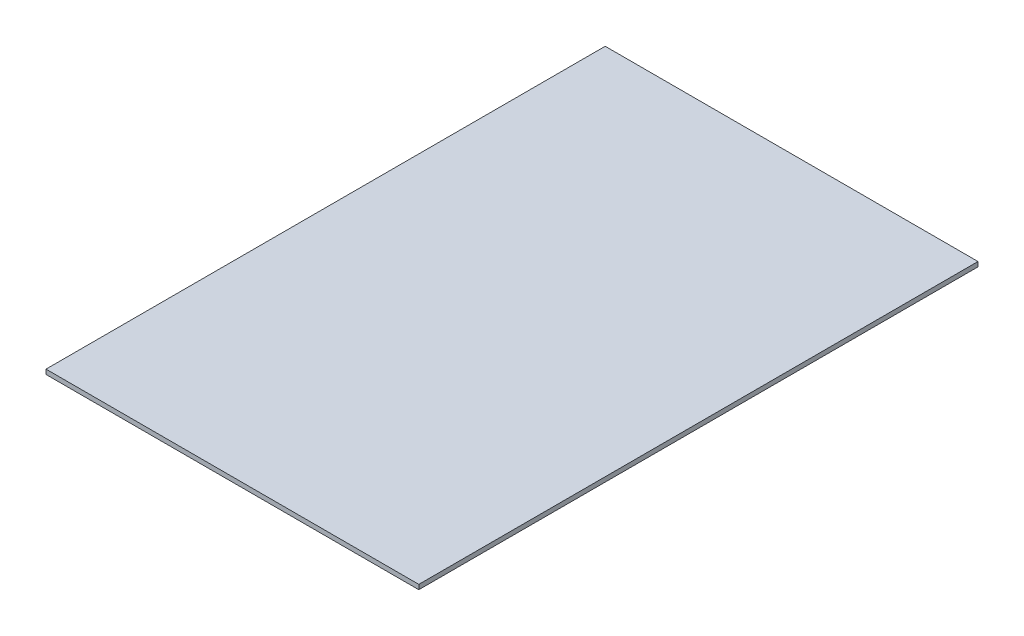
ISO-10303-21;
HEADER;
FILE_DESCRIPTION(('STEP AP214'),'2;1');
FILE_NAME('part.step','',(''),(''),'','','');
FILE_SCHEMA(('AUTOMOTIVE_DESIGN { 1 0 10303 214 1 1 1 1 }'));
ENDSEC;
DATA;
#1=APPLICATION_CONTEXT('core data for automotive mechanical design processes');
#2=APPLICATION_PROTOCOL_DEFINITION('international standard','automotive_design',2000,#1);
#3=PRODUCT_CONTEXT('',#1,'mechanical');
#4=PRODUCT('Part','Part','',(#3));
#5=PRODUCT_RELATED_PRODUCT_CATEGORY('part','',(#4));
#6=PRODUCT_DEFINITION_FORMATION('','',#4);
#7=PRODUCT_DEFINITION_CONTEXT('part definition',#1,'design');
#8=PRODUCT_DEFINITION('design','',#6,#7);
#9=PRODUCT_DEFINITION_SHAPE('','',#8);
#10=(LENGTH_UNIT() NAMED_UNIT(*) SI_UNIT(.MILLI.,.METRE.));
#11=(NAMED_UNIT(*) PLANE_ANGLE_UNIT() SI_UNIT($,.RADIAN.));
#12=(NAMED_UNIT(*) SI_UNIT($,.STERADIAN.) SOLID_ANGLE_UNIT());
#13=UNCERTAINTY_MEASURE_WITH_UNIT(LENGTH_MEASURE(1.E-05),#10,'distance_accuracy_value','');
#14=(GEOMETRIC_REPRESENTATION_CONTEXT(3) GLOBAL_UNCERTAINTY_ASSIGNED_CONTEXT((#13)) GLOBAL_UNIT_ASSIGNED_CONTEXT((#10,
#11,#12)) REPRESENTATION_CONTEXT('',''));
#15=CARTESIAN_POINT('',(0.,0.,0.));
#16=DIRECTION('',(0.,0.,1.));
#17=DIRECTION('',(1.,0.,0.));
#18=AXIS2_PLACEMENT_3D('',#15,#16,#17);
#19=CARTESIAN_POINT('',(-400.,10.,-600.));
#20=DIRECTION('',(1.,0.,0.));
#21=DIRECTION('',(0.,0.,-1.));
#22=AXIS2_PLACEMENT_3D('',#19,#20,#21);
#23=PLANE('',#22);
#24=DIRECTION('',(0.,0.,1.));
#25=VECTOR('',#24,1.);
#26=CARTESIAN_POINT('',(-400.,0.,-600.));
#27=LINE('',#26,#25);
#28=CARTESIAN_POINT('',(-400.,0.,-600.));
#29=VERTEX_POINT('',#28);
#30=CARTESIAN_POINT('',(-400.,0.,600.));
#31=VERTEX_POINT('',#30);
#32=EDGE_CURVE('E95',#29,#31,#27,.T.);
#33=ORIENTED_EDGE('',*,*,#32,.T.);
#34=DIRECTION('',(0.,-1.,0.));
#35=VECTOR('',#34,1.);
#36=CARTESIAN_POINT('',(-400.,10.,600.));
#37=LINE('',#36,#35);
#38=CARTESIAN_POINT('',(-400.,10.,600.));
#39=VERTEX_POINT('',#38);
#40=EDGE_CURVE('E11',#39,#31,#37,.T.);
#41=ORIENTED_EDGE('',*,*,#40,.F.);
#42=DIRECTION('',(0.,0.,1.));
#43=VECTOR('',#42,1.);
#44=CARTESIAN_POINT('',(-400.,10.,-600.));
#45=LINE('',#44,#43);
#46=CARTESIAN_POINT('',(-400.,10.,-600.));
#47=VERTEX_POINT('',#46);
#48=EDGE_CURVE('E83',#47,#39,#45,.T.);
#49=ORIENTED_EDGE('',*,*,#48,.F.);
#50=DIRECTION('',(0.,-1.,0.));
#51=VECTOR('',#50,1.);
#52=CARTESIAN_POINT('',(-400.,10.,-600.));
#53=LINE('',#52,#51);
#54=EDGE_CURVE('E91',#47,#29,#53,.T.);
#55=ORIENTED_EDGE('',*,*,#54,.T.);
#56=EDGE_LOOP('',(#33,#41,#49,#55));
#57=FACE_BOUND('',#56,.T.);
#58=ADVANCED_FACE('F32',(#57),#23,.F.);
#59=CARTESIAN_POINT('',(400.,10.,600.));
#60=DIRECTION('',(0.,0.,-1.));
#61=DIRECTION('',(-1.,0.,0.));
#62=AXIS2_PLACEMENT_3D('',#59,#60,#61);
#63=PLANE('',#62);
#64=DIRECTION('',(1.,0.,0.));
#65=VECTOR('',#64,1.);
#66=CARTESIAN_POINT('',(400.,0.,600.));
#67=LINE('',#66,#65);
#68=CARTESIAN_POINT('',(400.,0.,600.));
#69=VERTEX_POINT('',#68);
#70=EDGE_CURVE('E87',#31,#69,#67,.T.);
#71=ORIENTED_EDGE('',*,*,#70,.T.);
#72=DIRECTION('',(0.,-1.,0.));
#73=VECTOR('',#72,1.);
#74=CARTESIAN_POINT('',(400.,10.,600.));
#75=LINE('',#74,#73);
#76=CARTESIAN_POINT('',(400.,10.,600.));
#77=VERTEX_POINT('',#76);
#78=EDGE_CURVE('E40',#77,#69,#75,.T.);
#79=ORIENTED_EDGE('',*,*,#78,.F.);
#80=DIRECTION('',(1.,0.,0.));
#81=VECTOR('',#80,1.);
#82=CARTESIAN_POINT('',(400.,10.,600.));
#83=LINE('',#82,#81);
#84=EDGE_CURVE('E78',#39,#77,#83,.T.);
#85=ORIENTED_EDGE('',*,*,#84,.F.);
#86=ORIENTED_EDGE('',*,*,#40,.T.);
#87=EDGE_LOOP('',(#71,#79,#85,#86));
#88=FACE_BOUND('',#87,.T.);
#89=ADVANCED_FACE('F86',(#88),#63,.F.);
#90=CARTESIAN_POINT('',(400.,10.,-600.));
#91=DIRECTION('',(-1.,0.,0.));
#92=DIRECTION('',(0.,0.,1.));
#93=AXIS2_PLACEMENT_3D('',#90,#91,#92);
#94=PLANE('',#93);
#95=DIRECTION('',(0.,0.,-1.));
#96=VECTOR('',#95,1.);
#97=CARTESIAN_POINT('',(400.,0.,-600.));
#98=LINE('',#97,#96);
#99=CARTESIAN_POINT('',(400.,0.,-600.));
#100=VERTEX_POINT('',#99);
#101=EDGE_CURVE('E65',#69,#100,#98,.T.);
#102=ORIENTED_EDGE('',*,*,#101,.T.);
#103=DIRECTION('',(0.,-1.,0.));
#104=VECTOR('',#103,1.);
#105=CARTESIAN_POINT('',(400.,10.,-600.));
#106=LINE('',#105,#104);
#107=CARTESIAN_POINT('',(400.,10.,-600.));
#108=VERTEX_POINT('',#107);
#109=EDGE_CURVE('E88',#108,#100,#106,.T.);
#110=ORIENTED_EDGE('',*,*,#109,.F.);
#111=DIRECTION('',(0.,0.,-1.));
#112=VECTOR('',#111,1.);
#113=CARTESIAN_POINT('',(400.,10.,-600.));
#114=LINE('',#113,#112);
#115=EDGE_CURVE('E81',#77,#108,#114,.T.);
#116=ORIENTED_EDGE('',*,*,#115,.F.);
#117=ORIENTED_EDGE('',*,*,#78,.T.);
#118=EDGE_LOOP('',(#102,#110,#116,#117));
#119=FACE_BOUND('',#118,.T.);
#120=ADVANCED_FACE('F89',(#119),#94,.F.);
#121=CARTESIAN_POINT('',(400.,10.,-600.));
#122=DIRECTION('',(0.,0.,1.));
#123=DIRECTION('',(1.,0.,0.));
#124=AXIS2_PLACEMENT_3D('',#121,#122,#123);
#125=PLANE('',#124);
#126=DIRECTION('',(-1.,0.,0.));
#127=VECTOR('',#126,1.);
#128=CARTESIAN_POINT('',(400.,0.,-600.));
#129=LINE('',#128,#127);
#130=EDGE_CURVE('E71',#100,#29,#129,.T.);
#131=ORIENTED_EDGE('',*,*,#130,.T.);
#132=ORIENTED_EDGE('',*,*,#54,.F.);
#133=DIRECTION('',(-1.,0.,0.));
#134=VECTOR('',#133,1.);
#135=CARTESIAN_POINT('',(400.,10.,-600.));
#136=LINE('',#135,#134);
#137=EDGE_CURVE('E48',#108,#47,#136,.T.);
#138=ORIENTED_EDGE('',*,*,#137,.F.);
#139=ORIENTED_EDGE('',*,*,#109,.T.);
#140=EDGE_LOOP('',(#131,#132,#138,#139));
#141=FACE_BOUND('',#140,.T.);
#142=ADVANCED_FACE('F102',(#141),#125,.F.);
#143=CARTESIAN_POINT('',(0.,10.,0.));
#144=DIRECTION('',(0.,-1.,0.));
#145=DIRECTION('',(0.,0.,-1.));
#146=AXIS2_PLACEMENT_3D('',#143,#144,#145);
#147=PLANE('',#146);
#148=ORIENTED_EDGE('',*,*,#48,.T.);
#149=ORIENTED_EDGE('',*,*,#84,.T.);
#150=ORIENTED_EDGE('',*,*,#115,.T.);
#151=ORIENTED_EDGE('',*,*,#137,.T.);
#152=EDGE_LOOP('',(#148,#149,#150,#151));
#153=FACE_BOUND('',#152,.T.);
#154=ADVANCED_FACE('F79',(#153),#147,.F.);
#155=CARTESIAN_POINT('',(0.,0.,0.));
#156=DIRECTION('',(0.,-1.,0.));
#157=DIRECTION('',(0.,0.,-1.));
#158=AXIS2_PLACEMENT_3D('',#155,#156,#157);
#159=PLANE('',#158);
#160=ORIENTED_EDGE('',*,*,#32,.F.);
#161=ORIENTED_EDGE('',*,*,#130,.F.);
#162=ORIENTED_EDGE('',*,*,#101,.F.);
#163=ORIENTED_EDGE('',*,*,#70,.F.);
#164=EDGE_LOOP('',(#160,#161,#162,#163));
#165=FACE_BOUND('',#164,.T.);
#166=ADVANCED_FACE('F105',(#165),#159,.T.);
#167=CLOSED_SHELL('',(#58,#89,#120,#142,#154,#166));
#168=MANIFOLD_SOLID_BREP('B2',#167);
#169=ADVANCED_BREP_SHAPE_REPRESENTATION('',(#18,#168),#14);
#170=SHAPE_DEFINITION_REPRESENTATION(#9,#169);
ENDSEC;
END-ISO-10303-21;
